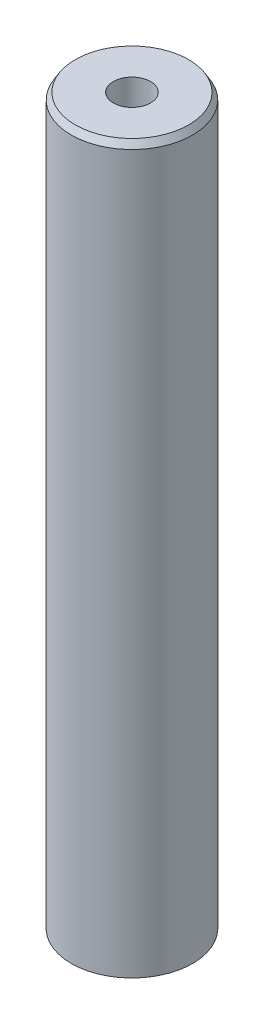
ISO-10303-21;
HEADER;
FILE_DESCRIPTION(('STEP AP214'),'2;1');
FILE_NAME('part.step','',(''),(''),'','','');
FILE_SCHEMA(('AUTOMOTIVE_DESIGN { 1 0 10303 214 1 1 1 1 }'));
ENDSEC;
DATA;
#1=APPLICATION_CONTEXT('core data for automotive mechanical design processes');
#2=APPLICATION_PROTOCOL_DEFINITION('international standard','automotive_design',2000,#1);
#3=PRODUCT_CONTEXT('',#1,'mechanical');
#4=PRODUCT('Part','Part','',(#3));
#5=PRODUCT_RELATED_PRODUCT_CATEGORY('part','',(#4));
#6=PRODUCT_DEFINITION_FORMATION('','',#4);
#7=PRODUCT_DEFINITION_CONTEXT('part definition',#1,'design');
#8=PRODUCT_DEFINITION('design','',#6,#7);
#9=PRODUCT_DEFINITION_SHAPE('','',#8);
#10=(LENGTH_UNIT() NAMED_UNIT(*) SI_UNIT(.MILLI.,.METRE.));
#11=(NAMED_UNIT(*) PLANE_ANGLE_UNIT() SI_UNIT($,.RADIAN.));
#12=(NAMED_UNIT(*) SI_UNIT($,.STERADIAN.) SOLID_ANGLE_UNIT());
#13=UNCERTAINTY_MEASURE_WITH_UNIT(LENGTH_MEASURE(1.E-05),#10,'distance_accuracy_value','');
#14=(GEOMETRIC_REPRESENTATION_CONTEXT(3) GLOBAL_UNCERTAINTY_ASSIGNED_CONTEXT((#13)) GLOBAL_UNIT_ASSIGNED_CONTEXT((#10,
#11,#12)) REPRESENTATION_CONTEXT('',''));
#15=CARTESIAN_POINT('',(0.,0.,0.));
#16=DIRECTION('',(0.,0.,1.));
#17=DIRECTION('',(1.,0.,0.));
#18=AXIS2_PLACEMENT_3D('',#15,#16,#17);
#19=CARTESIAN_POINT('',(0.,600.,0.));
#20=DIRECTION('',(0.,-1.,0.));
#21=DIRECTION('',(0.,0.,-1.));
#22=AXIS2_PLACEMENT_3D('',#19,#20,#21);
#23=CYLINDRICAL_SURFACE('',#22,50.);
#24=CARTESIAN_POINT('',(0.,594.457978344775,0.));
#25=DIRECTION('',(0.,1.,0.));
#26=DIRECTION('',(0.,0.,1.));
#27=AXIS2_PLACEMENT_3D('',#24,#25,#26);
#28=CIRCLE('',#27,50.);
#29=CARTESIAN_POINT('',(0.,594.457978344775,50.));
#30=VERTEX_POINT('',#29);
#31=EDGE_CURVE('E50',#30,#30,#28,.F.);
#32=ORIENTED_EDGE('',*,*,#31,.T.);
#33=EDGE_LOOP('',(#32));
#34=FACE_BOUND('',#33,.T.);
#35=CARTESIAN_POINT('',(0.,3.33587822943227,0.));
#36=DIRECTION('',(0.,1.,0.));
#37=DIRECTION('',(0.,0.,1.));
#38=AXIS2_PLACEMENT_3D('',#35,#36,#37);
#39=CIRCLE('',#38,50.);
#40=CARTESIAN_POINT('',(0.,3.33587822943227,50.));
#41=VERTEX_POINT('',#40);
#42=EDGE_CURVE('E51',#41,#41,#39,.T.);
#43=ORIENTED_EDGE('',*,*,#42,.T.);
#44=EDGE_LOOP('',(#43));
#45=FACE_BOUND('',#44,.T.);
#46=ADVANCED_FACE('F39',(#34,#45),#23,.T.);
#47=CARTESIAN_POINT('',(0.,600.,0.));
#48=DIRECTION('',(0.,1.,0.));
#49=DIRECTION('',(0.,0.,1.));
#50=AXIS2_PLACEMENT_3D('',#47,#48,#49);
#51=PLANE('',#50);
#52=CARTESIAN_POINT('',(0.,600.,0.));
#53=DIRECTION('',(0.,1.,0.));
#54=DIRECTION('',(0.,0.,1.));
#55=AXIS2_PLACEMENT_3D('',#52,#53,#54);
#56=CIRCLE('',#55,46.6641217705676);
#57=CARTESIAN_POINT('',(0.,600.,46.6641217705676));
#58=VERTEX_POINT('',#57);
#59=EDGE_CURVE('E54',#58,#58,#56,.T.);
#60=ORIENTED_EDGE('',*,*,#59,.T.);
#61=EDGE_LOOP('',(#60));
#62=FACE_BOUND('',#61,.T.);
#63=CARTESIAN_POINT('',(0.,600.,0.));
#64=DIRECTION('',(0.,1.,0.));
#65=DIRECTION('',(0.,0.,1.));
#66=AXIS2_PLACEMENT_3D('',#63,#64,#65);
#67=CIRCLE('',#66,15.3326229963001);
#68=CARTESIAN_POINT('',(0.,600.,15.3326229963001));
#69=VERTEX_POINT('',#68);
#70=EDGE_CURVE('E58',#69,#69,#67,.T.);
#71=ORIENTED_EDGE('',*,*,#70,.F.);
#72=EDGE_LOOP('',(#71));
#73=FACE_BOUND('',#72,.T.);
#74=ADVANCED_FACE('F69',(#62,#73),#51,.T.);
#75=CARTESIAN_POINT('',(0.,0.,0.));
#76=DIRECTION('',(0.,1.,0.));
#77=DIRECTION('',(0.,0.,1.));
#78=AXIS2_PLACEMENT_3D('',#75,#76,#77);
#79=PLANE('',#78);
#80=CARTESIAN_POINT('',(0.,0.,0.));
#81=DIRECTION('',(0.,1.,0.));
#82=DIRECTION('',(0.,0.,1.));
#83=AXIS2_PLACEMENT_3D('',#80,#81,#82);
#84=CIRCLE('',#83,44.4579783447752);
#85=CARTESIAN_POINT('',(0.,0.,44.4579783447752));
#86=VERTEX_POINT('',#85);
#87=EDGE_CURVE('E10',#86,#86,#84,.F.);
#88=ORIENTED_EDGE('',*,*,#87,.T.);
#89=EDGE_LOOP('',(#88));
#90=FACE_BOUND('',#89,.T.);
#91=CARTESIAN_POINT('',(0.,0.,0.));
#92=DIRECTION('',(0.,1.,0.));
#93=DIRECTION('',(0.,0.,1.));
#94=AXIS2_PLACEMENT_3D('',#91,#92,#93);
#95=CIRCLE('',#94,15.3326229963001);
#96=CARTESIAN_POINT('',(0.,0.,15.3326229963001));
#97=VERTEX_POINT('',#96);
#98=EDGE_CURVE('E63',#97,#97,#95,.T.);
#99=ORIENTED_EDGE('',*,*,#98,.T.);
#100=EDGE_LOOP('',(#99));
#101=FACE_BOUND('',#100,.T.);
#102=ADVANCED_FACE('F75',(#90,#101),#79,.F.);
#103=CARTESIAN_POINT('',(0.,600.,0.));
#104=DIRECTION('',(0.,-1.,0.));
#105=DIRECTION('',(0.,0.,-1.));
#106=AXIS2_PLACEMENT_3D('',#103,#104,#105);
#107=CYLINDRICAL_SURFACE('',#106,15.3326229963001);
#108=ORIENTED_EDGE('',*,*,#70,.T.);
#109=EDGE_LOOP('',(#108));
#110=FACE_BOUND('',#109,.T.);
#111=ORIENTED_EDGE('',*,*,#98,.F.);
#112=EDGE_LOOP('',(#111));
#113=FACE_BOUND('',#112,.T.);
#114=ADVANCED_FACE('F70',(#110,#113),#107,.F.);
#115=CARTESIAN_POINT('',(0.,600.,0.));
#116=DIRECTION('',(0.,-1.,0.));
#117=DIRECTION('',(0.,0.,-1.));
#118=AXIS2_PLACEMENT_3D('',#115,#116,#117);
#119=CONICAL_SURFACE('',#118,46.6641217705676,0.54183332150603);
#120=ORIENTED_EDGE('',*,*,#31,.F.);
#121=EDGE_LOOP('',(#120));
#122=FACE_BOUND('',#121,.T.);
#123=ORIENTED_EDGE('',*,*,#59,.F.);
#124=EDGE_LOOP('',(#123));
#125=FACE_BOUND('',#124,.T.);
#126=ADVANCED_FACE('F81',(#122,#125),#119,.T.);
#127=CARTESIAN_POINT('',(0.,3.33587822943227,0.));
#128=DIRECTION('',(0.,1.,0.));
#129=DIRECTION('',(0.,0.,1.));
#130=AXIS2_PLACEMENT_3D('',#127,#128,#129);
#131=CONICAL_SURFACE('',#130,50.,1.02896300528887);
#132=ORIENTED_EDGE('',*,*,#87,.F.);
#133=EDGE_LOOP('',(#132));
#134=FACE_BOUND('',#133,.T.);
#135=ORIENTED_EDGE('',*,*,#42,.F.);
#136=EDGE_LOOP('',(#135));
#137=FACE_BOUND('',#136,.T.);
#138=ADVANCED_FACE('F45',(#134,#137),#131,.T.);
#139=CLOSED_SHELL('',(#46,#74,#102,#114,#126,#138));
#140=MANIFOLD_SOLID_BREP('B2',#139);
#141=ADVANCED_BREP_SHAPE_REPRESENTATION('',(#18,#140),#14);
#142=SHAPE_DEFINITION_REPRESENTATION(#9,#141);
ENDSEC;
END-ISO-10303-21;
